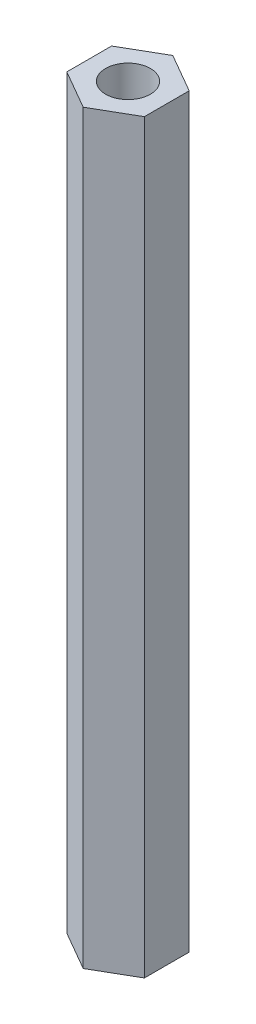
ISO-10303-21;
HEADER;
FILE_DESCRIPTION(('STEP AP214'),'2;1');
FILE_NAME('part.step','',(''),(''),'','','');
FILE_SCHEMA(('AUTOMOTIVE_DESIGN { 1 0 10303 214 1 1 1 1 }'));
ENDSEC;
DATA;
#1=APPLICATION_CONTEXT('core data for automotive mechanical design processes');
#2=APPLICATION_PROTOCOL_DEFINITION('international standard','automotive_design',2000,#1);
#3=PRODUCT_CONTEXT('',#1,'mechanical');
#4=PRODUCT('Part','Part','',(#3));
#5=PRODUCT_RELATED_PRODUCT_CATEGORY('part','',(#4));
#6=PRODUCT_DEFINITION_FORMATION('','',#4);
#7=PRODUCT_DEFINITION_CONTEXT('part definition',#1,'design');
#8=PRODUCT_DEFINITION('design','',#6,#7);
#9=PRODUCT_DEFINITION_SHAPE('','',#8);
#10=(LENGTH_UNIT() NAMED_UNIT(*) SI_UNIT(.MILLI.,.METRE.));
#11=(NAMED_UNIT(*) PLANE_ANGLE_UNIT() SI_UNIT($,.RADIAN.));
#12=(NAMED_UNIT(*) SI_UNIT($,.STERADIAN.) SOLID_ANGLE_UNIT());
#13=UNCERTAINTY_MEASURE_WITH_UNIT(LENGTH_MEASURE(1.E-05),#10,'distance_accuracy_value','');
#14=(GEOMETRIC_REPRESENTATION_CONTEXT(3) GLOBAL_UNCERTAINTY_ASSIGNED_CONTEXT((#13)) GLOBAL_UNIT_ASSIGNED_CONTEXT((#10,
#11,#12)) REPRESENTATION_CONTEXT('',''));
#15=CARTESIAN_POINT('',(0.,0.,0.));
#16=DIRECTION('',(0.,0.,1.));
#17=DIRECTION('',(1.,0.,0.));
#18=AXIS2_PLACEMENT_3D('',#15,#16,#17);
#19=CARTESIAN_POINT('',(0.,50.,0.));
#20=DIRECTION('',(0.,1.,0.));
#21=DIRECTION('',(0.,0.,1.));
#22=AXIS2_PLACEMENT_3D('',#19,#20,#21);
#23=PLANE('',#22);
#24=DIRECTION('',(-0.866025403784439,0.,-0.499999999999999));
#25=VECTOR('',#24,1.);
#26=CARTESIAN_POINT('',(2.6,50.,-1.50111069989303));
#27=LINE('',#26,#25);
#28=CARTESIAN_POINT('',(2.6,50.,-1.50111069989303));
#29=VERTEX_POINT('',#28);
#30=CARTESIAN_POINT('',(0.,50.,-3.00222139978605));
#31=VERTEX_POINT('',#30);
#32=EDGE_CURVE('E150',#29,#31,#27,.T.);
#33=ORIENTED_EDGE('',*,*,#32,.T.);
#34=DIRECTION('',(-0.866025403784438,0.,0.500000000000001));
#35=VECTOR('',#34,1.);
#36=CARTESIAN_POINT('',(0.,50.,-3.00222139978605));
#37=LINE('',#36,#35);
#38=CARTESIAN_POINT('',(-2.6,50.,-1.50111069989303));
#39=VERTEX_POINT('',#38);
#40=EDGE_CURVE('E98',#31,#39,#37,.T.);
#41=ORIENTED_EDGE('',*,*,#40,.T.);
#42=DIRECTION('',(0.,0.,1.));
#43=VECTOR('',#42,1.);
#44=CARTESIAN_POINT('',(-2.6,50.,-1.50111069989303));
#45=LINE('',#44,#43);
#46=CARTESIAN_POINT('',(-2.6,50.,1.50111069989303));
#47=VERTEX_POINT('',#46);
#48=EDGE_CURVE('E111',#39,#47,#45,.T.);
#49=ORIENTED_EDGE('',*,*,#48,.T.);
#50=DIRECTION('',(0.866025403784437,0.,0.500000000000003));
#51=VECTOR('',#50,1.);
#52=CARTESIAN_POINT('',(-2.6,50.,1.50111069989303));
#53=LINE('',#52,#51);
#54=CARTESIAN_POINT('',(0.,50.,3.00222139978606));
#55=VERTEX_POINT('',#54);
#56=EDGE_CURVE('E105',#47,#55,#53,.T.);
#57=ORIENTED_EDGE('',*,*,#56,.T.);
#58=DIRECTION('',(0.866025403784438,0.,-0.5));
#59=VECTOR('',#58,1.);
#60=CARTESIAN_POINT('',(0.,50.,3.00222139978606));
#61=LINE('',#60,#59);
#62=CARTESIAN_POINT('',(2.6,50.,1.50111069989303));
#63=VERTEX_POINT('',#62);
#64=EDGE_CURVE('E109',#55,#63,#61,.T.);
#65=ORIENTED_EDGE('',*,*,#64,.T.);
#66=DIRECTION('',(0.,0.,-1.));
#67=VECTOR('',#66,1.);
#68=CARTESIAN_POINT('',(2.6,50.,1.50111069989303));
#69=LINE('',#68,#67);
#70=EDGE_CURVE('E61',#63,#29,#69,.T.);
#71=ORIENTED_EDGE('',*,*,#70,.T.);
#72=EDGE_LOOP('',(#33,#41,#49,#57,#65,#71));
#73=FACE_BOUND('',#72,.T.);
#74=CARTESIAN_POINT('',(0.,50.,0.));
#75=DIRECTION('',(0.,1.,0.));
#76=DIRECTION('',(0.,0.,1.));
#77=AXIS2_PLACEMENT_3D('',#74,#75,#76);
#78=CIRCLE('',#77,1.5);
#79=CARTESIAN_POINT('',(0.,50.,1.5));
#80=VERTEX_POINT('',#79);
#81=EDGE_CURVE('E138',#80,#80,#78,.T.);
#82=ORIENTED_EDGE('',*,*,#81,.F.);
#83=EDGE_LOOP('',(#82));
#84=FACE_BOUND('',#83,.T.);
#85=ADVANCED_FACE('F43',(#73,#84),#23,.T.);
#86=CARTESIAN_POINT('',(0.,0.,0.));
#87=DIRECTION('',(0.,1.,0.));
#88=DIRECTION('',(0.,0.,1.));
#89=AXIS2_PLACEMENT_3D('',#86,#87,#88);
#90=PLANE('',#89);
#91=DIRECTION('',(-0.866025403784439,0.,-0.499999999999999));
#92=VECTOR('',#91,1.);
#93=CARTESIAN_POINT('',(2.6,0.,-1.50111069989303));
#94=LINE('',#93,#92);
#95=CARTESIAN_POINT('',(2.6,0.,-1.50111069989303));
#96=VERTEX_POINT('',#95);
#97=CARTESIAN_POINT('',(0.,0.,-3.00222139978605));
#98=VERTEX_POINT('',#97);
#99=EDGE_CURVE('E133',#96,#98,#94,.T.);
#100=ORIENTED_EDGE('',*,*,#99,.F.);
#101=DIRECTION('',(0.,0.,-1.));
#102=VECTOR('',#101,1.);
#103=CARTESIAN_POINT('',(2.6,0.,1.50111069989303));
#104=LINE('',#103,#102);
#105=CARTESIAN_POINT('',(2.6,0.,1.50111069989303));
#106=VERTEX_POINT('',#105);
#107=EDGE_CURVE('E90',#106,#96,#104,.T.);
#108=ORIENTED_EDGE('',*,*,#107,.F.);
#109=DIRECTION('',(0.866025403784438,0.,-0.5));
#110=VECTOR('',#109,1.);
#111=CARTESIAN_POINT('',(0.,0.,3.00222139978606));
#112=LINE('',#111,#110);
#113=CARTESIAN_POINT('',(0.,0.,3.00222139978606));
#114=VERTEX_POINT('',#113);
#115=EDGE_CURVE('E84',#114,#106,#112,.T.);
#116=ORIENTED_EDGE('',*,*,#115,.F.);
#117=DIRECTION('',(0.866025403784437,0.,0.500000000000003));
#118=VECTOR('',#117,1.);
#119=CARTESIAN_POINT('',(-2.6,0.,1.50111069989303));
#120=LINE('',#119,#118);
#121=CARTESIAN_POINT('',(-2.6,0.,1.50111069989303));
#122=VERTEX_POINT('',#121);
#123=EDGE_CURVE('E120',#122,#114,#120,.T.);
#124=ORIENTED_EDGE('',*,*,#123,.F.);
#125=DIRECTION('',(0.,0.,1.));
#126=VECTOR('',#125,1.);
#127=CARTESIAN_POINT('',(-2.6,0.,-1.50111069989303));
#128=LINE('',#127,#126);
#129=CARTESIAN_POINT('',(-2.6,0.,-1.50111069989303));
#130=VERTEX_POINT('',#129);
#131=EDGE_CURVE('E141',#130,#122,#128,.T.);
#132=ORIENTED_EDGE('',*,*,#131,.F.);
#133=DIRECTION('',(-0.866025403784438,0.,0.500000000000001));
#134=VECTOR('',#133,1.);
#135=CARTESIAN_POINT('',(0.,0.,-3.00222139978605));
#136=LINE('',#135,#134);
#137=EDGE_CURVE('E137',#98,#130,#136,.T.);
#138=ORIENTED_EDGE('',*,*,#137,.F.);
#139=EDGE_LOOP('',(#100,#108,#116,#124,#132,#138));
#140=FACE_BOUND('',#139,.T.);
#141=CARTESIAN_POINT('',(0.,0.,0.));
#142=DIRECTION('',(0.,1.,0.));
#143=DIRECTION('',(0.,0.,1.));
#144=AXIS2_PLACEMENT_3D('',#141,#142,#143);
#145=CIRCLE('',#144,1.5);
#146=CARTESIAN_POINT('',(0.,0.,1.5));
#147=VERTEX_POINT('',#146);
#148=EDGE_CURVE('E265',#147,#147,#145,.T.);
#149=ORIENTED_EDGE('',*,*,#148,.T.);
#150=EDGE_LOOP('',(#149));
#151=FACE_BOUND('',#150,.T.);
#152=ADVANCED_FACE('F163',(#140,#151),#90,.F.);
#153=CARTESIAN_POINT('',(2.6,50.,-1.50111069989303));
#154=DIRECTION('',(-0.499999999999999,0.,0.866025403784439));
#155=DIRECTION('',(0.866025403784439,0.,0.499999999999999));
#156=AXIS2_PLACEMENT_3D('',#153,#154,#155);
#157=PLANE('',#156);
#158=ORIENTED_EDGE('',*,*,#99,.T.);
#159=DIRECTION('',(0.,-1.,0.));
#160=VECTOR('',#159,1.);
#161=CARTESIAN_POINT('',(0.,50.,-3.00222139978605));
#162=LINE('',#161,#160);
#163=EDGE_CURVE('E11',#31,#98,#162,.T.);
#164=ORIENTED_EDGE('',*,*,#163,.F.);
#165=ORIENTED_EDGE('',*,*,#32,.F.);
#166=DIRECTION('',(0.,-1.,0.));
#167=VECTOR('',#166,1.);
#168=CARTESIAN_POINT('',(2.6,50.,-1.50111069989303));
#169=LINE('',#168,#167);
#170=EDGE_CURVE('E129',#29,#96,#169,.T.);
#171=ORIENTED_EDGE('',*,*,#170,.T.);
#172=EDGE_LOOP('',(#158,#164,#165,#171));
#173=FACE_BOUND('',#172,.T.);
#174=ADVANCED_FACE('F45',(#173),#157,.F.);
#175=CARTESIAN_POINT('',(0.,50.,-3.00222139978605));
#176=DIRECTION('',(0.500000000000001,0.,0.866025403784438));
#177=DIRECTION('',(0.866025403784438,0.,-0.500000000000001));
#178=AXIS2_PLACEMENT_3D('',#175,#176,#177);
#179=PLANE('',#178);
#180=ORIENTED_EDGE('',*,*,#137,.T.);
#181=DIRECTION('',(0.,-1.,0.));
#182=VECTOR('',#181,1.);
#183=CARTESIAN_POINT('',(-2.6,50.,-1.50111069989303));
#184=LINE('',#183,#182);
#185=EDGE_CURVE('E53',#39,#130,#184,.T.);
#186=ORIENTED_EDGE('',*,*,#185,.F.);
#187=ORIENTED_EDGE('',*,*,#40,.F.);
#188=ORIENTED_EDGE('',*,*,#163,.T.);
#189=EDGE_LOOP('',(#180,#186,#187,#188));
#190=FACE_BOUND('',#189,.T.);
#191=ADVANCED_FACE('F188',(#190),#179,.F.);
#192=CARTESIAN_POINT('',(-2.6,50.,-1.50111069989303));
#193=DIRECTION('',(1.,0.,0.));
#194=DIRECTION('',(0.,0.,-1.));
#195=AXIS2_PLACEMENT_3D('',#192,#193,#194);
#196=PLANE('',#195);
#197=ORIENTED_EDGE('',*,*,#131,.T.);
#198=DIRECTION('',(0.,-1.,0.));
#199=VECTOR('',#198,1.);
#200=CARTESIAN_POINT('',(-2.6,50.,1.50111069989303));
#201=LINE('',#200,#199);
#202=EDGE_CURVE('E122',#47,#122,#201,.T.);
#203=ORIENTED_EDGE('',*,*,#202,.F.);
#204=ORIENTED_EDGE('',*,*,#48,.F.);
#205=ORIENTED_EDGE('',*,*,#185,.T.);
#206=EDGE_LOOP('',(#197,#203,#204,#205));
#207=FACE_BOUND('',#206,.T.);
#208=ADVANCED_FACE('F160',(#207),#196,.F.);
#209=CARTESIAN_POINT('',(-2.6,50.,1.50111069989303));
#210=DIRECTION('',(0.500000000000003,0.,-0.866025403784437));
#211=DIRECTION('',(-0.866025403784437,0.,-0.500000000000003));
#212=AXIS2_PLACEMENT_3D('',#209,#210,#211);
#213=PLANE('',#212);
#214=ORIENTED_EDGE('',*,*,#123,.T.);
#215=DIRECTION('',(0.,-1.,0.));
#216=VECTOR('',#215,1.);
#217=CARTESIAN_POINT('',(0.,50.,3.00222139978606));
#218=LINE('',#217,#216);
#219=EDGE_CURVE('E117',#55,#114,#218,.T.);
#220=ORIENTED_EDGE('',*,*,#219,.F.);
#221=ORIENTED_EDGE('',*,*,#56,.F.);
#222=ORIENTED_EDGE('',*,*,#202,.T.);
#223=EDGE_LOOP('',(#214,#220,#221,#222));
#224=FACE_BOUND('',#223,.T.);
#225=ADVANCED_FACE('F118',(#224),#213,.F.);
#226=CARTESIAN_POINT('',(0.,50.,3.00222139978606));
#227=DIRECTION('',(-0.5,0.,-0.866025403784438));
#228=DIRECTION('',(-0.866025403784439,0.,0.5));
#229=AXIS2_PLACEMENT_3D('',#226,#227,#228);
#230=PLANE('',#229);
#231=ORIENTED_EDGE('',*,*,#115,.T.);
#232=DIRECTION('',(0.,-1.,0.));
#233=VECTOR('',#232,1.);
#234=CARTESIAN_POINT('',(2.6,50.,1.50111069989303));
#235=LINE('',#234,#233);
#236=EDGE_CURVE('E123',#63,#106,#235,.T.);
#237=ORIENTED_EDGE('',*,*,#236,.F.);
#238=ORIENTED_EDGE('',*,*,#64,.F.);
#239=ORIENTED_EDGE('',*,*,#219,.T.);
#240=EDGE_LOOP('',(#231,#237,#238,#239));
#241=FACE_BOUND('',#240,.T.);
#242=ADVANCED_FACE('F125',(#241),#230,.F.);
#243=CARTESIAN_POINT('',(2.6,50.,1.50111069989303));
#244=DIRECTION('',(-1.,0.,0.));
#245=DIRECTION('',(0.,0.,1.));
#246=AXIS2_PLACEMENT_3D('',#243,#244,#245);
#247=PLANE('',#246);
#248=ORIENTED_EDGE('',*,*,#107,.T.);
#249=ORIENTED_EDGE('',*,*,#170,.F.);
#250=ORIENTED_EDGE('',*,*,#70,.F.);
#251=ORIENTED_EDGE('',*,*,#236,.T.);
#252=EDGE_LOOP('',(#248,#249,#250,#251));
#253=FACE_BOUND('',#252,.T.);
#254=ADVANCED_FACE('F168',(#253),#247,.F.);
#255=CARTESIAN_POINT('',(0.,50.,0.));
#256=DIRECTION('',(0.,-1.,0.));
#257=DIRECTION('',(0.,0.,-1.));
#258=AXIS2_PLACEMENT_3D('',#255,#256,#257);
#259=CYLINDRICAL_SURFACE('',#258,1.5);
#260=ORIENTED_EDGE('',*,*,#81,.T.);
#261=EDGE_LOOP('',(#260));
#262=FACE_BOUND('',#261,.T.);
#263=ORIENTED_EDGE('',*,*,#148,.F.);
#264=EDGE_LOOP('',(#263));
#265=FACE_BOUND('',#264,.T.);
#266=ADVANCED_FACE('F170',(#262,#265),#259,.F.);
#267=CLOSED_SHELL('',(#85,#152,#174,#191,#208,#225,#242,#254,#266));
#268=MANIFOLD_SOLID_BREP('B2',#267);
#269=ADVANCED_BREP_SHAPE_REPRESENTATION('',(#18,#268),#14);
#270=SHAPE_DEFINITION_REPRESENTATION(#9,#269);
ENDSEC;
END-ISO-10303-21;
